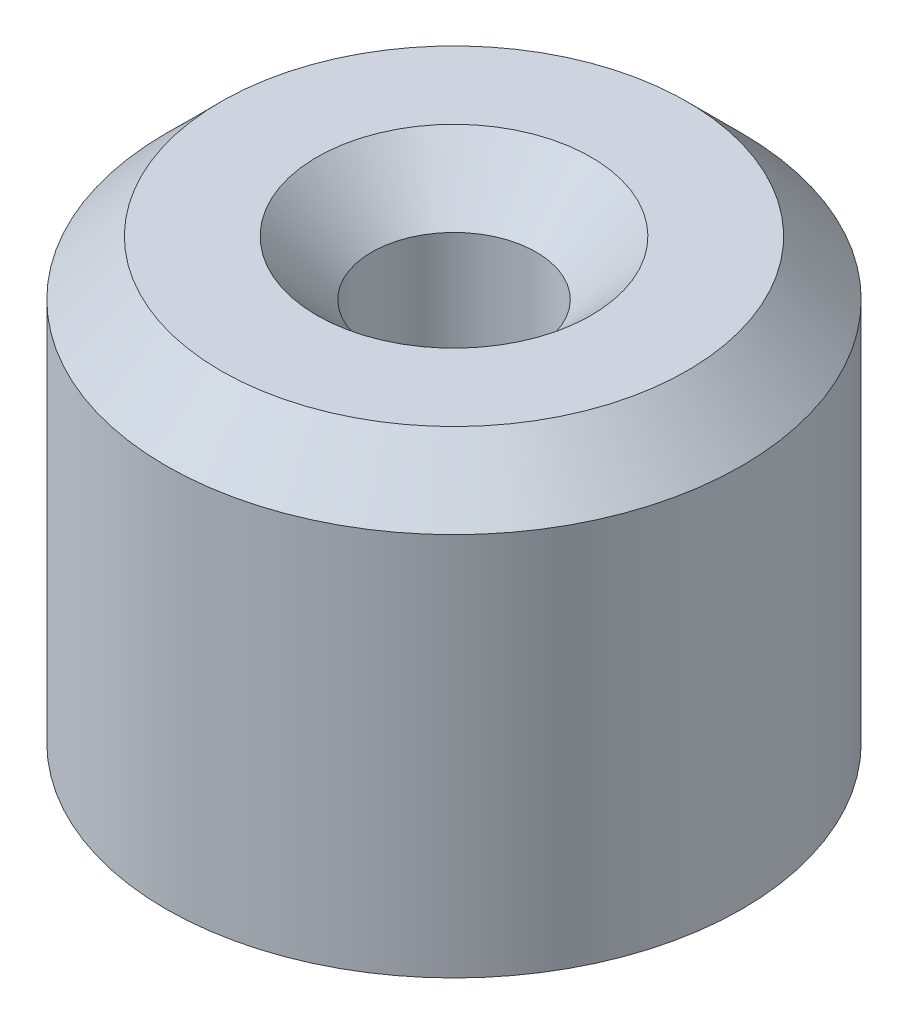
ISO-10303-21;
HEADER;
FILE_DESCRIPTION(('STEP AP214'),'2;1');
FILE_NAME('part.step','',(''),(''),'','','');
FILE_SCHEMA(('AUTOMOTIVE_DESIGN { 1 0 10303 214 1 1 1 1 }'));
ENDSEC;
DATA;
#1=APPLICATION_CONTEXT('core data for automotive mechanical design processes');
#2=APPLICATION_PROTOCOL_DEFINITION('international standard','automotive_design',2000,#1);
#3=PRODUCT_CONTEXT('',#1,'mechanical');
#4=PRODUCT('Part','Part','',(#3));
#5=PRODUCT_RELATED_PRODUCT_CATEGORY('part','',(#4));
#6=PRODUCT_DEFINITION_FORMATION('','',#4);
#7=PRODUCT_DEFINITION_CONTEXT('part definition',#1,'design');
#8=PRODUCT_DEFINITION('design','',#6,#7);
#9=PRODUCT_DEFINITION_SHAPE('','',#8);
#10=(LENGTH_UNIT() NAMED_UNIT(*) SI_UNIT(.MILLI.,.METRE.));
#11=(NAMED_UNIT(*) PLANE_ANGLE_UNIT() SI_UNIT($,.RADIAN.));
#12=(NAMED_UNIT(*) SI_UNIT($,.STERADIAN.) SOLID_ANGLE_UNIT());
#13=UNCERTAINTY_MEASURE_WITH_UNIT(LENGTH_MEASURE(1.E-05),#10,'distance_accuracy_value','');
#14=(GEOMETRIC_REPRESENTATION_CONTEXT(3) GLOBAL_UNCERTAINTY_ASSIGNED_CONTEXT((#13)) GLOBAL_UNIT_ASSIGNED_CONTEXT((#10,
#11,#12)) REPRESENTATION_CONTEXT('',''));
#15=CARTESIAN_POINT('',(0.,0.,0.));
#16=DIRECTION('',(0.,0.,1.));
#17=DIRECTION('',(1.,0.,0.));
#18=AXIS2_PLACEMENT_3D('',#15,#16,#17);
#19=CARTESIAN_POINT('',(0.,8.,0.));
#20=DIRECTION('',(0.,-1.,0.));
#21=DIRECTION('',(0.,0.,-1.));
#22=AXIS2_PLACEMENT_3D('',#19,#20,#21);
#23=CYLINDRICAL_SURFACE('',#22,5.25);
#24=CARTESIAN_POINT('',(0.,6.99999999999999,0.));
#25=DIRECTION('',(0.,1.,0.));
#26=DIRECTION('',(0.,0.,1.));
#27=AXIS2_PLACEMENT_3D('',#24,#25,#26);
#28=CIRCLE('',#27,5.25);
#29=CARTESIAN_POINT('',(0.,6.99999999999999,5.25));
#30=VERTEX_POINT('',#29);
#31=EDGE_CURVE('E58',#30,#30,#28,.F.);
#32=ORIENTED_EDGE('',*,*,#31,.T.);
#33=EDGE_LOOP('',(#32));
#34=FACE_BOUND('',#33,.T.);
#35=CARTESIAN_POINT('',(0.,0.,0.));
#36=DIRECTION('',(0.,1.,0.));
#37=DIRECTION('',(0.,0.,1.));
#38=AXIS2_PLACEMENT_3D('',#35,#36,#37);
#39=CIRCLE('',#38,5.25);
#40=CARTESIAN_POINT('',(0.,0.,5.25));
#41=VERTEX_POINT('',#40);
#42=EDGE_CURVE('E69',#41,#41,#39,.T.);
#43=ORIENTED_EDGE('',*,*,#42,.T.);
#44=EDGE_LOOP('',(#43));
#45=FACE_BOUND('',#44,.T.);
#46=ADVANCED_FACE('F44',(#34,#45),#23,.T.);
#47=CARTESIAN_POINT('',(0.,8.,0.));
#48=DIRECTION('',(0.,1.,0.));
#49=DIRECTION('',(0.,0.,1.));
#50=AXIS2_PLACEMENT_3D('',#47,#48,#49);
#51=PLANE('',#50);
#52=CARTESIAN_POINT('',(0.,8.,0.));
#53=DIRECTION('',(0.,1.,0.));
#54=DIRECTION('',(0.,0.,1.));
#55=AXIS2_PLACEMENT_3D('',#52,#53,#54);
#56=CIRCLE('',#55,2.5);
#57=CARTESIAN_POINT('',(0.,8.,2.5));
#58=VERTEX_POINT('',#57);
#59=EDGE_CURVE('E11',#58,#58,#56,.F.);
#60=ORIENTED_EDGE('',*,*,#59,.T.);
#61=EDGE_LOOP('',(#60));
#62=FACE_BOUND('',#61,.T.);
#63=CARTESIAN_POINT('',(0.,8.,0.));
#64=DIRECTION('',(0.,1.,0.));
#65=DIRECTION('',(0.,0.,1.));
#66=AXIS2_PLACEMENT_3D('',#63,#64,#65);
#67=CIRCLE('',#66,4.25);
#68=CARTESIAN_POINT('',(0.,8.,4.25));
#69=VERTEX_POINT('',#68);
#70=EDGE_CURVE('E63',#69,#69,#67,.T.);
#71=ORIENTED_EDGE('',*,*,#70,.T.);
#72=EDGE_LOOP('',(#71));
#73=FACE_BOUND('',#72,.T.);
#74=ADVANCED_FACE('F112',(#62,#73),#51,.T.);
#75=CARTESIAN_POINT('',(0.,0.,0.));
#76=DIRECTION('',(0.,1.,0.));
#77=DIRECTION('',(0.,0.,1.));
#78=AXIS2_PLACEMENT_3D('',#75,#76,#77);
#79=PLANE('',#78);
#80=CARTESIAN_POINT('',(0.,0.,0.));
#81=DIRECTION('',(0.,1.,0.));
#82=DIRECTION('',(0.,0.,1.));
#83=AXIS2_PLACEMENT_3D('',#80,#81,#82);
#84=CIRCLE('',#83,4.15);
#85=CARTESIAN_POINT('',(0.,0.,4.15));
#86=VERTEX_POINT('',#85);
#87=EDGE_CURVE('E79',#86,#86,#84,.T.);
#88=ORIENTED_EDGE('',*,*,#87,.T.);
#89=EDGE_LOOP('',(#88));
#90=FACE_BOUND('',#89,.T.);
#91=ORIENTED_EDGE('',*,*,#42,.F.);
#92=EDGE_LOOP('',(#91));
#93=FACE_BOUND('',#92,.T.);
#94=ADVANCED_FACE('F118',(#90,#93),#79,.F.);
#95=CARTESIAN_POINT('',(0.,-4.24264068711929,0.));
#96=DIRECTION('',(0.,1.,0.));
#97=DIRECTION('',(0.,0.,1.));
#98=AXIS2_PLACEMENT_3D('',#95,#96,#97);
#99=CYLINDRICAL_SURFACE('',#98,1.5);
#100=CARTESIAN_POINT('',(0.,7.,0.));
#101=DIRECTION('',(0.,1.,0.));
#102=DIRECTION('',(0.,0.,1.));
#103=AXIS2_PLACEMENT_3D('',#100,#101,#102);
#104=CIRCLE('',#103,1.5);
#105=CARTESIAN_POINT('',(0.,7.,1.5));
#106=VERTEX_POINT('',#105);
#107=EDGE_CURVE('E53',#106,#106,#104,.T.);
#108=ORIENTED_EDGE('',*,*,#107,.T.);
#109=EDGE_LOOP('',(#108));
#110=FACE_BOUND('',#109,.T.);
#111=CARTESIAN_POINT('',(0.,0.9,0.));
#112=DIRECTION('',(0.,1.,0.));
#113=DIRECTION('',(0.,0.,1.));
#114=AXIS2_PLACEMENT_3D('',#111,#112,#113);
#115=CIRCLE('',#114,1.5);
#116=CARTESIAN_POINT('',(0.,0.9,1.5));
#117=VERTEX_POINT('',#116);
#118=EDGE_CURVE('E70',#117,#117,#115,.T.);
#119=ORIENTED_EDGE('',*,*,#118,.F.);
#120=EDGE_LOOP('',(#119));
#121=FACE_BOUND('',#120,.T.);
#122=ADVANCED_FACE('F109',(#110,#121),#99,.F.);
#123=CARTESIAN_POINT('',(0.,8.,0.));
#124=DIRECTION('',(0.,-1.,0.));
#125=DIRECTION('',(0.,0.,-1.));
#126=AXIS2_PLACEMENT_3D('',#123,#124,#125);
#127=CYLINDRICAL_SURFACE('',#126,4.15);
#128=CARTESIAN_POINT('',(0.,6.9,0.));
#129=DIRECTION('',(0.,1.,0.));
#130=DIRECTION('',(0.,0.,1.));
#131=AXIS2_PLACEMENT_3D('',#128,#129,#130);
#132=CIRCLE('',#131,4.15);
#133=CARTESIAN_POINT('',(0.,6.9,4.15));
#134=VERTEX_POINT('',#133);
#135=EDGE_CURVE('E78',#134,#134,#132,.T.);
#136=ORIENTED_EDGE('',*,*,#135,.T.);
#137=EDGE_LOOP('',(#136));
#138=FACE_BOUND('',#137,.T.);
#139=ORIENTED_EDGE('',*,*,#87,.F.);
#140=EDGE_LOOP('',(#139));
#141=FACE_BOUND('',#140,.T.);
#142=ADVANCED_FACE('F94',(#138,#141),#127,.F.);
#143=CARTESIAN_POINT('',(0.,6.9,0.));
#144=DIRECTION('',(0.,1.,0.));
#145=DIRECTION('',(0.,0.,1.));
#146=AXIS2_PLACEMENT_3D('',#143,#144,#145);
#147=PLANE('',#146);
#148=CARTESIAN_POINT('',(0.,6.9,0.));
#149=DIRECTION('',(0.,1.,0.));
#150=DIRECTION('',(0.,0.,1.));
#151=AXIS2_PLACEMENT_3D('',#148,#149,#150);
#152=CIRCLE('',#151,2.6);
#153=CARTESIAN_POINT('',(0.,6.9,2.6));
#154=VERTEX_POINT('',#153);
#155=EDGE_CURVE('E74',#154,#154,#152,.T.);
#156=ORIENTED_EDGE('',*,*,#155,.T.);
#157=EDGE_LOOP('',(#156));
#158=FACE_BOUND('',#157,.T.);
#159=ORIENTED_EDGE('',*,*,#135,.F.);
#160=EDGE_LOOP('',(#159));
#161=FACE_BOUND('',#160,.T.);
#162=ADVANCED_FACE('F97',(#158,#161),#147,.F.);
#163=CARTESIAN_POINT('',(0.,-4.24264068711929,0.));
#164=DIRECTION('',(0.,1.,0.));
#165=DIRECTION('',(0.,0.,1.));
#166=AXIS2_PLACEMENT_3D('',#163,#164,#165);
#167=CYLINDRICAL_SURFACE('',#166,2.6);
#168=CARTESIAN_POINT('',(0.,0.9,0.));
#169=DIRECTION('',(0.,1.,0.));
#170=DIRECTION('',(0.,0.,1.));
#171=AXIS2_PLACEMENT_3D('',#168,#169,#170);
#172=CIRCLE('',#171,2.6);
#173=CARTESIAN_POINT('',(0.,0.9,2.6));
#174=VERTEX_POINT('',#173);
#175=EDGE_CURVE('E83',#174,#174,#172,.F.);
#176=ORIENTED_EDGE('',*,*,#175,.F.);
#177=EDGE_LOOP('',(#176));
#178=FACE_BOUND('',#177,.T.);
#179=ORIENTED_EDGE('',*,*,#155,.F.);
#180=EDGE_LOOP('',(#179));
#181=FACE_BOUND('',#180,.T.);
#182=ADVANCED_FACE('F99',(#178,#181),#167,.T.);
#183=CARTESIAN_POINT('',(0.,0.9,0.));
#184=DIRECTION('',(0.,1.,0.));
#185=DIRECTION('',(0.,0.,1.));
#186=AXIS2_PLACEMENT_3D('',#183,#184,#185);
#187=PLANE('',#186);
#188=ORIENTED_EDGE('',*,*,#118,.T.);
#189=EDGE_LOOP('',(#188));
#190=FACE_BOUND('',#189,.T.);
#191=ORIENTED_EDGE('',*,*,#175,.T.);
#192=EDGE_LOOP('',(#191));
#193=FACE_BOUND('',#192,.T.);
#194=ADVANCED_FACE('F106',(#190,#193),#187,.F.);
#195=CARTESIAN_POINT('',(0.,8.,0.));
#196=DIRECTION('',(0.,-1.,0.));
#197=DIRECTION('',(0.,0.,-1.));
#198=AXIS2_PLACEMENT_3D('',#195,#196,#197);
#199=CONICAL_SURFACE('',#198,4.25,0.785398163397447);
#200=ORIENTED_EDGE('',*,*,#31,.F.);
#201=EDGE_LOOP('',(#200));
#202=FACE_BOUND('',#201,.T.);
#203=ORIENTED_EDGE('',*,*,#70,.F.);
#204=EDGE_LOOP('',(#203));
#205=FACE_BOUND('',#204,.T.);
#206=ADVANCED_FACE('F123',(#202,#205),#199,.T.);
#207=CARTESIAN_POINT('',(0.,7.,0.));
#208=DIRECTION('',(0.,1.,0.));
#209=DIRECTION('',(0.,0.,1.));
#210=AXIS2_PLACEMENT_3D('',#207,#208,#209);
#211=CONICAL_SURFACE('',#210,1.5,0.78539816339745);
#212=ORIENTED_EDGE('',*,*,#59,.F.);
#213=EDGE_LOOP('',(#212));
#214=FACE_BOUND('',#213,.T.);
#215=ORIENTED_EDGE('',*,*,#107,.F.);
#216=EDGE_LOOP('',(#215));
#217=FACE_BOUND('',#216,.T.);
#218=ADVANCED_FACE('F47',(#214,#217),#211,.F.);
#219=CLOSED_SHELL('',(#46,#74,#94,#122,#142,#162,#182,#194,#206,#218));
#220=MANIFOLD_SOLID_BREP('B2',#219);
#221=ADVANCED_BREP_SHAPE_REPRESENTATION('',(#18,#220),#14);
#222=SHAPE_DEFINITION_REPRESENTATION(#9,#221);
ENDSEC;
END-ISO-10303-21;
